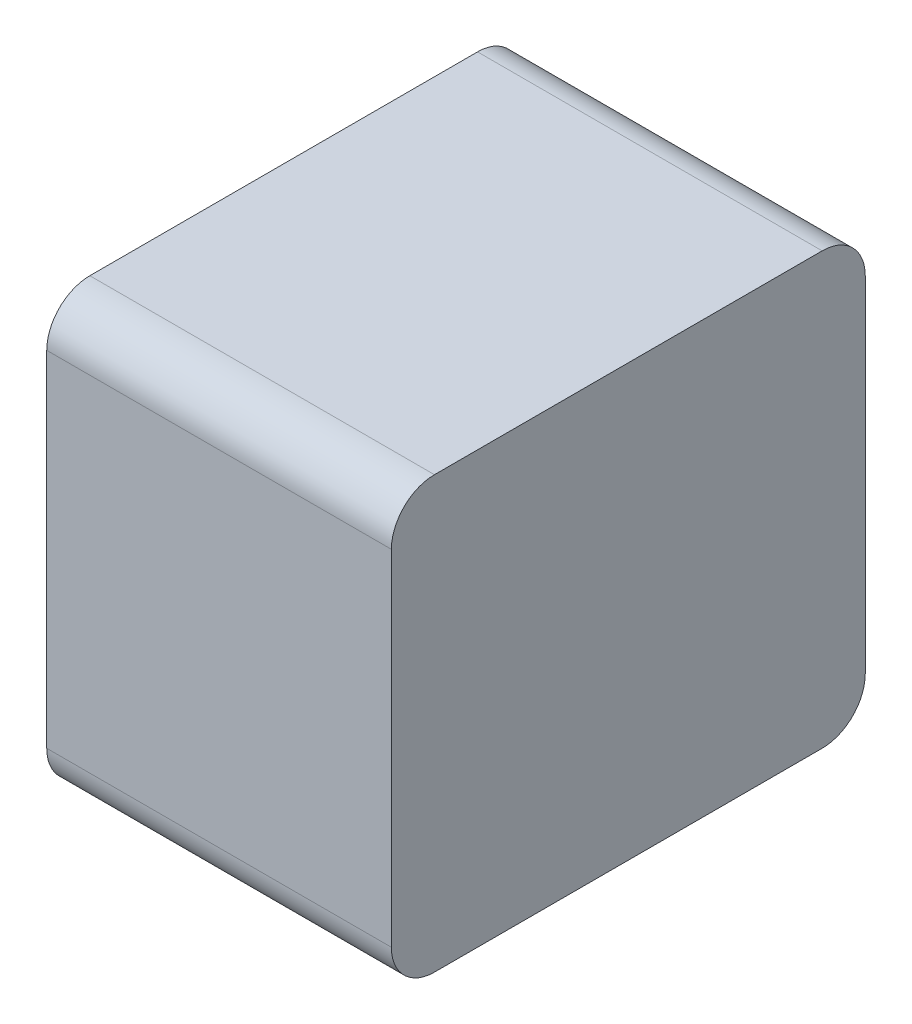
ISO-10303-21;
HEADER;
FILE_DESCRIPTION(('STEP AP214'),'2;1');
FILE_NAME('part.step','',(''),(''),'','','');
FILE_SCHEMA(('AUTOMOTIVE_DESIGN { 1 0 10303 214 1 1 1 1 }'));
ENDSEC;
DATA;
#1=APPLICATION_CONTEXT('core data for automotive mechanical design processes');
#2=APPLICATION_PROTOCOL_DEFINITION('international standard','automotive_design',2000,#1);
#3=PRODUCT_CONTEXT('',#1,'mechanical');
#4=PRODUCT('Part','Part','',(#3));
#5=PRODUCT_RELATED_PRODUCT_CATEGORY('part','',(#4));
#6=PRODUCT_DEFINITION_FORMATION('','',#4);
#7=PRODUCT_DEFINITION_CONTEXT('part definition',#1,'design');
#8=PRODUCT_DEFINITION('design','',#6,#7);
#9=PRODUCT_DEFINITION_SHAPE('','',#8);
#10=(LENGTH_UNIT() NAMED_UNIT(*) SI_UNIT(.MILLI.,.METRE.));
#11=(NAMED_UNIT(*) PLANE_ANGLE_UNIT() SI_UNIT($,.RADIAN.));
#12=(NAMED_UNIT(*) SI_UNIT($,.STERADIAN.) SOLID_ANGLE_UNIT());
#13=UNCERTAINTY_MEASURE_WITH_UNIT(LENGTH_MEASURE(1.E-05),#10,'distance_accuracy_value','');
#14=(GEOMETRIC_REPRESENTATION_CONTEXT(3) GLOBAL_UNCERTAINTY_ASSIGNED_CONTEXT((#13)) GLOBAL_UNIT_ASSIGNED_CONTEXT((#10,
#11,#12)) REPRESENTATION_CONTEXT('',''));
#15=CARTESIAN_POINT('',(0.,0.,0.));
#16=DIRECTION('',(0.,0.,1.));
#17=DIRECTION('',(1.,0.,0.));
#18=AXIS2_PLACEMENT_3D('',#15,#16,#17);
#19=CARTESIAN_POINT('',(0.2,-0.25,0.));
#20=DIRECTION('',(1.,0.,0.));
#21=DIRECTION('',(0.,0.,-1.));
#22=AXIS2_PLACEMENT_3D('',#19,#20,#21);
#23=PLANE('',#22);
#24=CARTESIAN_POINT('',(0.2,0.2,0.5));
#25=DIRECTION('',(-1.,0.,0.));
#26=DIRECTION('',(0.,0.,1.));
#27=AXIS2_PLACEMENT_3D('',#24,#25,#26);
#28=CIRCLE('',#27,0.05);
#29=CARTESIAN_POINT('',(0.2,0.2,0.55));
#30=VERTEX_POINT('',#29);
#31=CARTESIAN_POINT('',(0.2,0.25,0.5));
#32=VERTEX_POINT('',#31);
#33=EDGE_CURVE('E127',#30,#32,#28,.T.);
#34=ORIENTED_EDGE('',*,*,#33,.F.);
#35=DIRECTION('',(0.,1.,0.));
#36=VECTOR('',#35,1.);
#37=CARTESIAN_POINT('',(0.2,0.,0.55));
#38=LINE('',#37,#36);
#39=CARTESIAN_POINT('',(0.2,-0.2,0.55));
#40=VERTEX_POINT('',#39);
#41=EDGE_CURVE('E84',#40,#30,#38,.T.);
#42=ORIENTED_EDGE('',*,*,#41,.F.);
#43=CARTESIAN_POINT('',(0.2,-0.2,0.5));
#44=DIRECTION('',(1.,0.,0.));
#45=DIRECTION('',(0.,0.,-1.));
#46=AXIS2_PLACEMENT_3D('',#43,#44,#45);
#47=CIRCLE('',#46,0.05);
#48=CARTESIAN_POINT('',(0.2,-0.25,0.5));
#49=VERTEX_POINT('',#48);
#50=EDGE_CURVE('E20',#49,#40,#47,.F.);
#51=ORIENTED_EDGE('',*,*,#50,.F.);
#52=DIRECTION('',(0.,0.,-1.));
#53=VECTOR('',#52,1.);
#54=CARTESIAN_POINT('',(0.2,-0.25,0.));
#55=LINE('',#54,#53);
#56=CARTESIAN_POINT('',(0.2,-0.25,0.05));
#57=VERTEX_POINT('',#56);
#58=EDGE_CURVE('E83',#57,#49,#55,.F.);
#59=ORIENTED_EDGE('',*,*,#58,.F.);
#60=CARTESIAN_POINT('',(0.2,-0.2,0.05));
#61=DIRECTION('',(1.,0.,0.));
#62=DIRECTION('',(0.,0.,-1.));
#63=AXIS2_PLACEMENT_3D('',#60,#61,#62);
#64=CIRCLE('',#63,0.05);
#65=CARTESIAN_POINT('',(0.2,-0.2,0.));
#66=VERTEX_POINT('',#65);
#67=EDGE_CURVE('E124',#66,#57,#64,.F.);
#68=ORIENTED_EDGE('',*,*,#67,.F.);
#69=DIRECTION('',(0.,1.,0.));
#70=VECTOR('',#69,1.);
#71=CARTESIAN_POINT('',(0.2,0.,0.));
#72=LINE('',#71,#70);
#73=CARTESIAN_POINT('',(0.2,0.2,0.));
#74=VERTEX_POINT('',#73);
#75=EDGE_CURVE('E104',#66,#74,#72,.T.);
#76=ORIENTED_EDGE('',*,*,#75,.T.);
#77=CARTESIAN_POINT('',(0.2,0.2,0.05));
#78=DIRECTION('',(-1.,0.,0.));
#79=DIRECTION('',(0.,0.,1.));
#80=AXIS2_PLACEMENT_3D('',#77,#78,#79);
#81=CIRCLE('',#80,0.05);
#82=CARTESIAN_POINT('',(0.2,0.25,0.05));
#83=VERTEX_POINT('',#82);
#84=EDGE_CURVE('E107',#83,#74,#81,.T.);
#85=ORIENTED_EDGE('',*,*,#84,.F.);
#86=DIRECTION('',(0.,0.,1.));
#87=VECTOR('',#86,1.);
#88=CARTESIAN_POINT('',(0.2,0.25,0.));
#89=LINE('',#88,#87);
#90=EDGE_CURVE('E108',#32,#83,#89,.F.);
#91=ORIENTED_EDGE('',*,*,#90,.F.);
#92=EDGE_LOOP('',(#34,#42,#51,#59,#68,#76,#85,#91));
#93=FACE_BOUND('',#92,.T.);
#94=ADVANCED_FACE('F17',(#93),#23,.T.);
#95=CARTESIAN_POINT('',(-0.1,-0.2,0.5));
#96=DIRECTION('',(1.,0.,0.));
#97=DIRECTION('',(0.,0.,-1.));
#98=AXIS2_PLACEMENT_3D('',#95,#96,#97);
#99=CYLINDRICAL_SURFACE('',#98,0.05);
#100=CARTESIAN_POINT('',(-0.2,-0.2,0.5));
#101=DIRECTION('',(1.,0.,0.));
#102=DIRECTION('',(0.,0.,-1.));
#103=AXIS2_PLACEMENT_3D('',#100,#101,#102);
#104=CIRCLE('',#103,0.05);
#105=CARTESIAN_POINT('',(-0.2,-0.25,0.5));
#106=VERTEX_POINT('',#105);
#107=CARTESIAN_POINT('',(-0.2,-0.2,0.55));
#108=VERTEX_POINT('',#107);
#109=EDGE_CURVE('E92',#106,#108,#104,.F.);
#110=ORIENTED_EDGE('',*,*,#109,.F.);
#111=DIRECTION('',(1.,0.,0.));
#112=VECTOR('',#111,1.);
#113=CARTESIAN_POINT('',(-0.2,-0.25,0.5));
#114=LINE('',#113,#112);
#115=EDGE_CURVE('E89',#49,#106,#114,.F.);
#116=ORIENTED_EDGE('',*,*,#115,.F.);
#117=ORIENTED_EDGE('',*,*,#50,.T.);
#118=DIRECTION('',(1.,0.,0.));
#119=VECTOR('',#118,1.);
#120=CARTESIAN_POINT('',(0.,-0.2,0.55));
#121=LINE('',#120,#119);
#122=EDGE_CURVE('E87',#108,#40,#121,.T.);
#123=ORIENTED_EDGE('',*,*,#122,.F.);
#124=EDGE_LOOP('',(#110,#116,#117,#123));
#125=FACE_BOUND('',#124,.T.);
#126=ADVANCED_FACE('F90',(#125),#99,.T.);
#127=CARTESIAN_POINT('',(0.,0.,0.55));
#128=DIRECTION('',(0.,0.,1.));
#129=DIRECTION('',(1.,0.,0.));
#130=AXIS2_PLACEMENT_3D('',#127,#128,#129);
#131=PLANE('',#130);
#132=DIRECTION('',(-1.,0.,0.));
#133=VECTOR('',#132,1.);
#134=CARTESIAN_POINT('',(0.1,0.2,0.55));
#135=LINE('',#134,#133);
#136=CARTESIAN_POINT('',(-0.2,0.2,0.55));
#137=VERTEX_POINT('',#136);
#138=EDGE_CURVE('E113',#137,#30,#135,.F.);
#139=ORIENTED_EDGE('',*,*,#138,.F.);
#140=DIRECTION('',(0.,1.,0.));
#141=VECTOR('',#140,1.);
#142=CARTESIAN_POINT('',(-0.2,0.25,0.55));
#143=LINE('',#142,#141);
#144=EDGE_CURVE('E98',#108,#137,#143,.T.);
#145=ORIENTED_EDGE('',*,*,#144,.F.);
#146=ORIENTED_EDGE('',*,*,#122,.T.);
#147=ORIENTED_EDGE('',*,*,#41,.T.);
#148=EDGE_LOOP('',(#139,#145,#146,#147));
#149=FACE_BOUND('',#148,.T.);
#150=ADVANCED_FACE('F216',(#149),#131,.T.);
#151=CARTESIAN_POINT('',(0.1,0.2,0.5));
#152=DIRECTION('',(-1.,0.,0.));
#153=DIRECTION('',(0.,0.,1.));
#154=AXIS2_PLACEMENT_3D('',#151,#152,#153);
#155=CYLINDRICAL_SURFACE('',#154,0.05);
#156=ORIENTED_EDGE('',*,*,#33,.T.);
#157=DIRECTION('',(1.,0.,0.));
#158=VECTOR('',#157,1.);
#159=CARTESIAN_POINT('',(0.2,0.25,0.5));
#160=LINE('',#159,#158);
#161=CARTESIAN_POINT('',(-0.2,0.25,0.5));
#162=VERTEX_POINT('',#161);
#163=EDGE_CURVE('E111',#162,#32,#160,.T.);
#164=ORIENTED_EDGE('',*,*,#163,.F.);
#165=CARTESIAN_POINT('',(-0.2,0.2,0.5));
#166=DIRECTION('',(-1.,0.,0.));
#167=DIRECTION('',(0.,0.,1.));
#168=AXIS2_PLACEMENT_3D('',#165,#166,#167);
#169=CIRCLE('',#168,0.05);
#170=EDGE_CURVE('E121',#137,#162,#169,.T.);
#171=ORIENTED_EDGE('',*,*,#170,.F.);
#172=ORIENTED_EDGE('',*,*,#138,.T.);
#173=EDGE_LOOP('',(#156,#164,#171,#172));
#174=FACE_BOUND('',#173,.T.);
#175=ADVANCED_FACE('F206',(#174),#155,.T.);
#176=CARTESIAN_POINT('',(0.2,0.25,0.));
#177=DIRECTION('',(0.,1.,0.));
#178=DIRECTION('',(0.,0.,1.));
#179=AXIS2_PLACEMENT_3D('',#176,#177,#178);
#180=PLANE('',#179);
#181=DIRECTION('',(-1.,0.,0.));
#182=VECTOR('',#181,1.);
#183=CARTESIAN_POINT('',(0.1,0.25,0.05));
#184=LINE('',#183,#182);
#185=CARTESIAN_POINT('',(-0.2,0.25,0.05));
#186=VERTEX_POINT('',#185);
#187=EDGE_CURVE('E110',#186,#83,#184,.F.);
#188=ORIENTED_EDGE('',*,*,#187,.F.);
#189=DIRECTION('',(0.,0.,1.));
#190=VECTOR('',#189,1.);
#191=CARTESIAN_POINT('',(-0.2,0.25,0.));
#192=LINE('',#191,#190);
#193=EDGE_CURVE('E120',#162,#186,#192,.F.);
#194=ORIENTED_EDGE('',*,*,#193,.F.);
#195=ORIENTED_EDGE('',*,*,#163,.T.);
#196=ORIENTED_EDGE('',*,*,#90,.T.);
#197=EDGE_LOOP('',(#188,#194,#195,#196));
#198=FACE_BOUND('',#197,.T.);
#199=ADVANCED_FACE('F196',(#198),#180,.T.);
#200=CARTESIAN_POINT('',(0.1,0.2,0.05));
#201=DIRECTION('',(-1.,0.,0.));
#202=DIRECTION('',(0.,0.,1.));
#203=AXIS2_PLACEMENT_3D('',#200,#201,#202);
#204=CYLINDRICAL_SURFACE('',#203,0.05);
#205=ORIENTED_EDGE('',*,*,#84,.T.);
#206=DIRECTION('',(1.,0.,0.));
#207=VECTOR('',#206,1.);
#208=CARTESIAN_POINT('',(0.,0.2,0.));
#209=LINE('',#208,#207);
#210=CARTESIAN_POINT('',(-0.2,0.2,0.));
#211=VERTEX_POINT('',#210);
#212=EDGE_CURVE('E106',#74,#211,#209,.F.);
#213=ORIENTED_EDGE('',*,*,#212,.T.);
#214=CARTESIAN_POINT('',(-0.2,0.2,0.05));
#215=DIRECTION('',(-1.,0.,0.));
#216=DIRECTION('',(0.,0.,1.));
#217=AXIS2_PLACEMENT_3D('',#214,#215,#216);
#218=CIRCLE('',#217,0.05);
#219=EDGE_CURVE('E117',#186,#211,#218,.T.);
#220=ORIENTED_EDGE('',*,*,#219,.F.);
#221=ORIENTED_EDGE('',*,*,#187,.T.);
#222=EDGE_LOOP('',(#205,#213,#220,#221));
#223=FACE_BOUND('',#222,.T.);
#224=ADVANCED_FACE('F162',(#223),#204,.T.);
#225=CARTESIAN_POINT('',(0.,0.,0.));
#226=DIRECTION('',(0.,0.,1.));
#227=DIRECTION('',(1.,0.,0.));
#228=AXIS2_PLACEMENT_3D('',#225,#226,#227);
#229=PLANE('',#228);
#230=ORIENTED_EDGE('',*,*,#75,.F.);
#231=DIRECTION('',(1.,0.,0.));
#232=VECTOR('',#231,1.);
#233=CARTESIAN_POINT('',(-0.1,-0.2,0.));
#234=LINE('',#233,#232);
#235=CARTESIAN_POINT('',(-0.2,-0.2,0.));
#236=VERTEX_POINT('',#235);
#237=EDGE_CURVE('E94',#236,#66,#234,.T.);
#238=ORIENTED_EDGE('',*,*,#237,.F.);
#239=DIRECTION('',(0.,1.,0.));
#240=VECTOR('',#239,1.);
#241=CARTESIAN_POINT('',(-0.2,0.25,0.));
#242=LINE('',#241,#240);
#243=EDGE_CURVE('E116',#211,#236,#242,.F.);
#244=ORIENTED_EDGE('',*,*,#243,.F.);
#245=ORIENTED_EDGE('',*,*,#212,.F.);
#246=EDGE_LOOP('',(#230,#238,#244,#245));
#247=FACE_BOUND('',#246,.T.);
#248=ADVANCED_FACE('F152',(#247),#229,.F.);
#249=CARTESIAN_POINT('',(-0.1,-0.2,0.05));
#250=DIRECTION('',(1.,0.,0.));
#251=DIRECTION('',(0.,0.,-1.));
#252=AXIS2_PLACEMENT_3D('',#249,#250,#251);
#253=CYLINDRICAL_SURFACE('',#252,0.05);
#254=CARTESIAN_POINT('',(-0.2,-0.2,0.05));
#255=DIRECTION('',(1.,0.,0.));
#256=DIRECTION('',(0.,0.,-1.));
#257=AXIS2_PLACEMENT_3D('',#254,#255,#256);
#258=CIRCLE('',#257,0.05);
#259=CARTESIAN_POINT('',(-0.2,-0.25,0.05));
#260=VERTEX_POINT('',#259);
#261=EDGE_CURVE('E26',#236,#260,#258,.F.);
#262=ORIENTED_EDGE('',*,*,#261,.F.);
#263=ORIENTED_EDGE('',*,*,#237,.T.);
#264=ORIENTED_EDGE('',*,*,#67,.T.);
#265=DIRECTION('',(1.,0.,0.));
#266=VECTOR('',#265,1.);
#267=CARTESIAN_POINT('',(-0.2,-0.25,0.05));
#268=LINE('',#267,#266);
#269=EDGE_CURVE('E35',#260,#57,#268,.T.);
#270=ORIENTED_EDGE('',*,*,#269,.F.);
#271=EDGE_LOOP('',(#262,#263,#264,#270));
#272=FACE_BOUND('',#271,.T.);
#273=ADVANCED_FACE('F153',(#272),#253,.T.);
#274=CARTESIAN_POINT('',(-0.2,-0.25,0.));
#275=DIRECTION('',(0.,-1.,0.));
#276=DIRECTION('',(0.,0.,-1.));
#277=AXIS2_PLACEMENT_3D('',#274,#275,#276);
#278=PLANE('',#277);
#279=ORIENTED_EDGE('',*,*,#269,.T.);
#280=ORIENTED_EDGE('',*,*,#58,.T.);
#281=ORIENTED_EDGE('',*,*,#115,.T.);
#282=DIRECTION('',(0.,0.,1.));
#283=VECTOR('',#282,1.);
#284=CARTESIAN_POINT('',(-0.2,-0.25,0.));
#285=LINE('',#284,#283);
#286=EDGE_CURVE('E11',#260,#106,#285,.T.);
#287=ORIENTED_EDGE('',*,*,#286,.F.);
#288=EDGE_LOOP('',(#279,#280,#281,#287));
#289=FACE_BOUND('',#288,.T.);
#290=ADVANCED_FACE('F96',(#289),#278,.T.);
#291=CARTESIAN_POINT('',(-0.2,0.25,0.));
#292=DIRECTION('',(-1.,0.,0.));
#293=DIRECTION('',(0.,0.,1.));
#294=AXIS2_PLACEMENT_3D('',#291,#292,#293);
#295=PLANE('',#294);
#296=ORIENTED_EDGE('',*,*,#261,.T.);
#297=ORIENTED_EDGE('',*,*,#286,.T.);
#298=ORIENTED_EDGE('',*,*,#109,.T.);
#299=ORIENTED_EDGE('',*,*,#144,.T.);
#300=ORIENTED_EDGE('',*,*,#170,.T.);
#301=ORIENTED_EDGE('',*,*,#193,.T.);
#302=ORIENTED_EDGE('',*,*,#219,.T.);
#303=ORIENTED_EDGE('',*,*,#243,.T.);
#304=EDGE_LOOP('',(#296,#297,#298,#299,#300,#301,#302,#303));
#305=FACE_BOUND('',#304,.T.);
#306=ADVANCED_FACE('F147',(#305),#295,.T.);
#307=CLOSED_SHELL('',(#94,#126,#150,#175,#199,#224,#248,#273,#290,#306));
#308=MANIFOLD_SOLID_BREP('B1',#307);
#309=ADVANCED_BREP_SHAPE_REPRESENTATION('',(#18,#308),#14);
#310=SHAPE_DEFINITION_REPRESENTATION(#9,#309);
ENDSEC;
END-ISO-10303-21;
